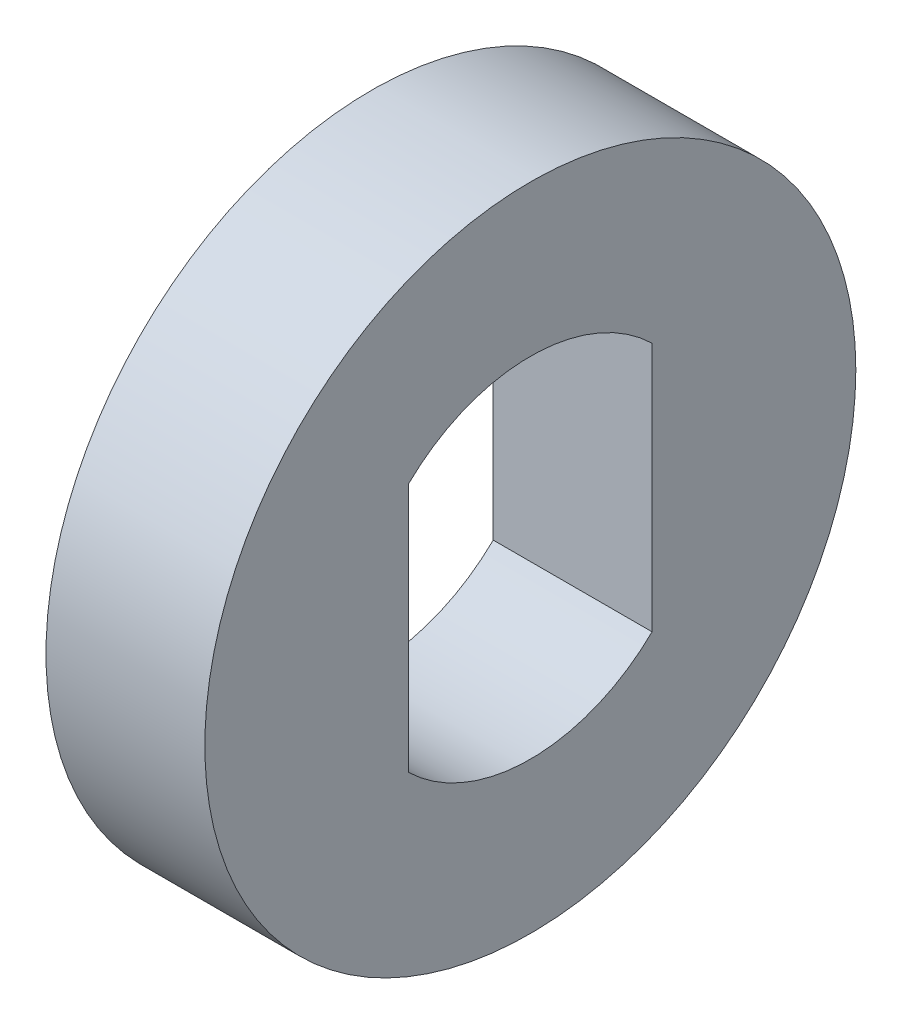
ISO-10303-21;
HEADER;
FILE_DESCRIPTION(('STEP AP214'),'2;1');
FILE_NAME('part.step','',(''),(''),'','','');
FILE_SCHEMA(('AUTOMOTIVE_DESIGN { 1 0 10303 214 1 1 1 1 }'));
ENDSEC;
DATA;
#1=APPLICATION_CONTEXT('core data for automotive mechanical design processes');
#2=APPLICATION_PROTOCOL_DEFINITION('international standard','automotive_design',2000,#1);
#3=PRODUCT_CONTEXT('',#1,'mechanical');
#4=PRODUCT('Part','Part','',(#3));
#5=PRODUCT_RELATED_PRODUCT_CATEGORY('part','',(#4));
#6=PRODUCT_DEFINITION_FORMATION('','',#4);
#7=PRODUCT_DEFINITION_CONTEXT('part definition',#1,'design');
#8=PRODUCT_DEFINITION('design','',#6,#7);
#9=PRODUCT_DEFINITION_SHAPE('','',#8);
#10=(LENGTH_UNIT() NAMED_UNIT(*) SI_UNIT(.MILLI.,.METRE.));
#11=(NAMED_UNIT(*) PLANE_ANGLE_UNIT() SI_UNIT($,.RADIAN.));
#12=(NAMED_UNIT(*) SI_UNIT($,.STERADIAN.) SOLID_ANGLE_UNIT());
#13=UNCERTAINTY_MEASURE_WITH_UNIT(LENGTH_MEASURE(1.E-05),#10,'distance_accuracy_value','');
#14=(GEOMETRIC_REPRESENTATION_CONTEXT(3) GLOBAL_UNCERTAINTY_ASSIGNED_CONTEXT((#13)) GLOBAL_UNIT_ASSIGNED_CONTEXT((#10,
#11,#12)) REPRESENTATION_CONTEXT('',''));
#15=CARTESIAN_POINT('',(0.,0.,0.));
#16=DIRECTION('',(0.,0.,1.));
#17=DIRECTION('',(1.,0.,0.));
#18=AXIS2_PLACEMENT_3D('',#15,#16,#17);
#19=CARTESIAN_POINT('',(2.44,0.,0.));
#20=DIRECTION('',(1.,0.,0.));
#21=DIRECTION('',(0.,0.,-1.));
#22=AXIS2_PLACEMENT_3D('',#19,#20,#21);
#23=PLANE('',#22);
#24=CARTESIAN_POINT('',(2.44,0.,0.));
#25=DIRECTION('',(1.,0.,0.));
#26=DIRECTION('',(0.,0.,-1.));
#27=AXIS2_PLACEMENT_3D('',#24,#25,#26);
#28=CIRCLE('',#27,5.);
#29=CARTESIAN_POINT('',(2.44,0.,-5.));
#30=VERTEX_POINT('',#29);
#31=EDGE_CURVE('E11',#30,#30,#28,.T.);
#32=ORIENTED_EDGE('',*,*,#31,.T.);
#33=EDGE_LOOP('',(#32));
#34=FACE_BOUND('',#33,.T.);
#35=DIRECTION('',(0.,-1.,0.));
#36=VECTOR('',#35,1.);
#37=CARTESIAN_POINT('',(2.44,1.91976561069314,1.87));
#38=LINE('',#37,#36);
#39=CARTESIAN_POINT('',(2.44,1.91976561069314,1.87));
#40=VERTEX_POINT('',#39);
#41=CARTESIAN_POINT('',(2.44,-1.91976561069314,1.87));
#42=VERTEX_POINT('',#41);
#43=EDGE_CURVE('E84',#40,#42,#38,.T.);
#44=ORIENTED_EDGE('',*,*,#43,.F.);
#45=CARTESIAN_POINT('',(2.44,0.,0.));
#46=DIRECTION('',(1.,0.,0.));
#47=DIRECTION('',(0.,0.,-1.));
#48=AXIS2_PLACEMENT_3D('',#45,#46,#47);
#49=CIRCLE('',#48,2.68);
#50=CARTESIAN_POINT('',(2.44,1.91976561069314,-1.87));
#51=VERTEX_POINT('',#50);
#52=EDGE_CURVE('E76',#51,#40,#49,.T.);
#53=ORIENTED_EDGE('',*,*,#52,.F.);
#54=DIRECTION('',(0.,1.,0.));
#55=VECTOR('',#54,1.);
#56=CARTESIAN_POINT('',(2.44,1.91976561069314,-1.87));
#57=LINE('',#56,#55);
#58=CARTESIAN_POINT('',(2.44,-1.91976561069314,-1.87));
#59=VERTEX_POINT('',#58);
#60=EDGE_CURVE('E97',#59,#51,#57,.T.);
#61=ORIENTED_EDGE('',*,*,#60,.F.);
#62=CARTESIAN_POINT('',(2.44,0.,0.));
#63=DIRECTION('',(1.,0.,0.));
#64=DIRECTION('',(0.,0.,-1.));
#65=AXIS2_PLACEMENT_3D('',#62,#63,#64);
#66=CIRCLE('',#65,2.68);
#67=EDGE_CURVE('E95',#42,#59,#66,.T.);
#68=ORIENTED_EDGE('',*,*,#67,.F.);
#69=EDGE_LOOP('',(#44,#53,#61,#68));
#70=FACE_BOUND('',#69,.T.);
#71=ADVANCED_FACE('F35',(#34,#70),#23,.T.);
#72=CARTESIAN_POINT('',(0.,0.,0.));
#73=DIRECTION('',(1.,0.,0.));
#74=DIRECTION('',(0.,0.,-1.));
#75=AXIS2_PLACEMENT_3D('',#72,#73,#74);
#76=PLANE('',#75);
#77=CARTESIAN_POINT('',(0.,0.,0.));
#78=DIRECTION('',(1.,0.,0.));
#79=DIRECTION('',(0.,0.,-1.));
#80=AXIS2_PLACEMENT_3D('',#77,#78,#79);
#81=CIRCLE('',#80,5.);
#82=CARTESIAN_POINT('',(0.,0.,-5.));
#83=VERTEX_POINT('',#82);
#84=EDGE_CURVE('E39',#83,#83,#81,.T.);
#85=ORIENTED_EDGE('',*,*,#84,.F.);
#86=EDGE_LOOP('',(#85));
#87=FACE_BOUND('',#86,.T.);
#88=CARTESIAN_POINT('',(0.,0.,0.));
#89=DIRECTION('',(1.,0.,0.));
#90=DIRECTION('',(0.,0.,-1.));
#91=AXIS2_PLACEMENT_3D('',#88,#89,#90);
#92=CIRCLE('',#91,2.68);
#93=CARTESIAN_POINT('',(0.,1.91976561069314,-1.87));
#94=VERTEX_POINT('',#93);
#95=CARTESIAN_POINT('',(0.,1.91976561069314,1.87));
#96=VERTEX_POINT('',#95);
#97=EDGE_CURVE('E58',#94,#96,#92,.T.);
#98=ORIENTED_EDGE('',*,*,#97,.T.);
#99=DIRECTION('',(0.,-1.,0.));
#100=VECTOR('',#99,1.);
#101=CARTESIAN_POINT('',(0.,1.91976561069314,1.87));
#102=LINE('',#101,#100);
#103=CARTESIAN_POINT('',(0.,-1.91976561069314,1.87));
#104=VERTEX_POINT('',#103);
#105=EDGE_CURVE('E91',#96,#104,#102,.T.);
#106=ORIENTED_EDGE('',*,*,#105,.T.);
#107=CARTESIAN_POINT('',(0.,0.,0.));
#108=DIRECTION('',(1.,0.,0.));
#109=DIRECTION('',(0.,0.,-1.));
#110=AXIS2_PLACEMENT_3D('',#107,#108,#109);
#111=CIRCLE('',#110,2.68);
#112=CARTESIAN_POINT('',(0.,-1.91976561069314,-1.87));
#113=VERTEX_POINT('',#112);
#114=EDGE_CURVE('E103',#104,#113,#111,.T.);
#115=ORIENTED_EDGE('',*,*,#114,.T.);
#116=DIRECTION('',(0.,1.,0.));
#117=VECTOR('',#116,1.);
#118=CARTESIAN_POINT('',(0.,1.91976561069314,-1.87));
#119=LINE('',#118,#117);
#120=EDGE_CURVE('E85',#113,#94,#119,.T.);
#121=ORIENTED_EDGE('',*,*,#120,.T.);
#122=EDGE_LOOP('',(#98,#106,#115,#121));
#123=FACE_BOUND('',#122,.T.);
#124=ADVANCED_FACE('F114',(#87,#123),#76,.F.);
#125=CARTESIAN_POINT('',(2.44,0.,0.));
#126=DIRECTION('',(-1.,0.,0.));
#127=DIRECTION('',(0.,0.,1.));
#128=AXIS2_PLACEMENT_3D('',#125,#126,#127);
#129=CYLINDRICAL_SURFACE('',#128,5.);
#130=ORIENTED_EDGE('',*,*,#31,.F.);
#131=EDGE_LOOP('',(#130));
#132=FACE_BOUND('',#131,.T.);
#133=ORIENTED_EDGE('',*,*,#84,.T.);
#134=EDGE_LOOP('',(#133));
#135=FACE_BOUND('',#134,.T.);
#136=ADVANCED_FACE('F37',(#132,#135),#129,.T.);
#137=CARTESIAN_POINT('',(2.44,0.,0.));
#138=DIRECTION('',(-1.,0.,0.));
#139=DIRECTION('',(0.,0.,1.));
#140=AXIS2_PLACEMENT_3D('',#137,#138,#139);
#141=CYLINDRICAL_SURFACE('',#140,2.68);
#142=ORIENTED_EDGE('',*,*,#97,.F.);
#143=DIRECTION('',(-1.,0.,0.));
#144=VECTOR('',#143,1.);
#145=CARTESIAN_POINT('',(2.44,1.91976561069314,-1.87));
#146=LINE('',#145,#144);
#147=EDGE_CURVE('E80',#51,#94,#146,.T.);
#148=ORIENTED_EDGE('',*,*,#147,.F.);
#149=ORIENTED_EDGE('',*,*,#52,.T.);
#150=DIRECTION('',(-1.,0.,0.));
#151=VECTOR('',#150,1.);
#152=CARTESIAN_POINT('',(2.44,1.91976561069314,1.87));
#153=LINE('',#152,#151);
#154=EDGE_CURVE('E79',#40,#96,#153,.T.);
#155=ORIENTED_EDGE('',*,*,#154,.T.);
#156=EDGE_LOOP('',(#142,#148,#149,#155));
#157=FACE_BOUND('',#156,.T.);
#158=ADVANCED_FACE('F78',(#157),#141,.F.);
#159=CARTESIAN_POINT('',(2.44,1.91976561069314,1.87));
#160=DIRECTION('',(0.,0.,-1.));
#161=DIRECTION('',(-1.,0.,0.));
#162=AXIS2_PLACEMENT_3D('',#159,#160,#161);
#163=PLANE('',#162);
#164=ORIENTED_EDGE('',*,*,#105,.F.);
#165=ORIENTED_EDGE('',*,*,#154,.F.);
#166=ORIENTED_EDGE('',*,*,#43,.T.);
#167=DIRECTION('',(-1.,0.,0.));
#168=VECTOR('',#167,1.);
#169=CARTESIAN_POINT('',(2.44,-1.91976561069314,1.87));
#170=LINE('',#169,#168);
#171=EDGE_CURVE('E92',#42,#104,#170,.T.);
#172=ORIENTED_EDGE('',*,*,#171,.T.);
#173=EDGE_LOOP('',(#164,#165,#166,#172));
#174=FACE_BOUND('',#173,.T.);
#175=ADVANCED_FACE('F88',(#174),#163,.T.);
#176=CARTESIAN_POINT('',(2.44,0.,0.));
#177=DIRECTION('',(-1.,0.,0.));
#178=DIRECTION('',(0.,0.,1.));
#179=AXIS2_PLACEMENT_3D('',#176,#177,#178);
#180=CYLINDRICAL_SURFACE('',#179,2.68);
#181=ORIENTED_EDGE('',*,*,#114,.F.);
#182=ORIENTED_EDGE('',*,*,#171,.F.);
#183=ORIENTED_EDGE('',*,*,#67,.T.);
#184=DIRECTION('',(-1.,0.,0.));
#185=VECTOR('',#184,1.);
#186=CARTESIAN_POINT('',(2.44,-1.91976561069314,-1.87));
#187=LINE('',#186,#185);
#188=EDGE_CURVE('E50',#59,#113,#187,.T.);
#189=ORIENTED_EDGE('',*,*,#188,.T.);
#190=EDGE_LOOP('',(#181,#182,#183,#189));
#191=FACE_BOUND('',#190,.T.);
#192=ADVANCED_FACE('F112',(#191),#180,.F.);
#193=CARTESIAN_POINT('',(2.44,1.91976561069314,-1.87));
#194=DIRECTION('',(0.,0.,1.));
#195=DIRECTION('',(1.,0.,0.));
#196=AXIS2_PLACEMENT_3D('',#193,#194,#195);
#197=PLANE('',#196);
#198=ORIENTED_EDGE('',*,*,#120,.F.);
#199=ORIENTED_EDGE('',*,*,#188,.F.);
#200=ORIENTED_EDGE('',*,*,#60,.T.);
#201=ORIENTED_EDGE('',*,*,#147,.T.);
#202=EDGE_LOOP('',(#198,#199,#200,#201));
#203=FACE_BOUND('',#202,.T.);
#204=ADVANCED_FACE('F115',(#203),#197,.T.);
#205=CLOSED_SHELL('',(#71,#124,#136,#158,#175,#192,#204));
#206=MANIFOLD_SOLID_BREP('B2',#205);
#207=ADVANCED_BREP_SHAPE_REPRESENTATION('',(#18,#206),#14);
#208=SHAPE_DEFINITION_REPRESENTATION(#9,#207);
ENDSEC;
END-ISO-10303-21;
